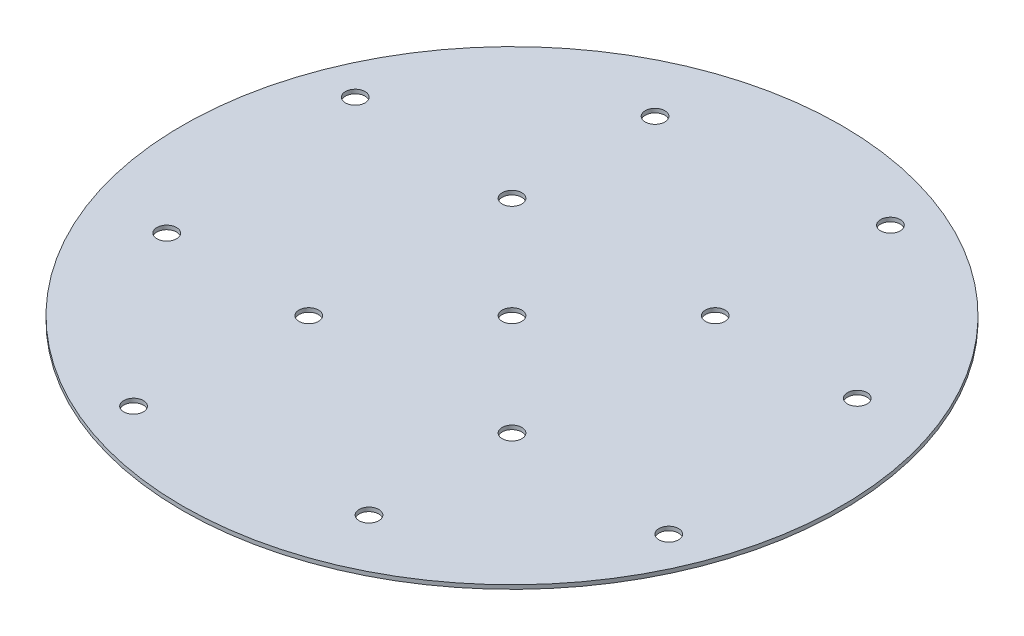
ISO-10303-21;
HEADER;
FILE_DESCRIPTION(('STEP AP214'),'2;1');
FILE_NAME('part.step','',(''),(''),'','','');
FILE_SCHEMA(('AUTOMOTIVE_DESIGN { 1 0 10303 214 1 1 1 1 }'));
ENDSEC;
DATA;
#1=APPLICATION_CONTEXT('core data for automotive mechanical design processes');
#2=APPLICATION_PROTOCOL_DEFINITION('international standard','automotive_design',2000,#1);
#3=PRODUCT_CONTEXT('',#1,'mechanical');
#4=PRODUCT('Part','Part','',(#3));
#5=PRODUCT_RELATED_PRODUCT_CATEGORY('part','',(#4));
#6=PRODUCT_DEFINITION_FORMATION('','',#4);
#7=PRODUCT_DEFINITION_CONTEXT('part definition',#1,'design');
#8=PRODUCT_DEFINITION('design','',#6,#7);
#9=PRODUCT_DEFINITION_SHAPE('','',#8);
#10=(LENGTH_UNIT() NAMED_UNIT(*) SI_UNIT(.MILLI.,.METRE.));
#11=(NAMED_UNIT(*) PLANE_ANGLE_UNIT() SI_UNIT($,.RADIAN.));
#12=(NAMED_UNIT(*) SI_UNIT($,.STERADIAN.) SOLID_ANGLE_UNIT());
#13=UNCERTAINTY_MEASURE_WITH_UNIT(LENGTH_MEASURE(1.E-05),#10,'distance_accuracy_value','');
#14=(GEOMETRIC_REPRESENTATION_CONTEXT(3) GLOBAL_UNCERTAINTY_ASSIGNED_CONTEXT((#13)) GLOBAL_UNIT_ASSIGNED_CONTEXT((#10,
#11,#12)) REPRESENTATION_CONTEXT('',''));
#15=CARTESIAN_POINT('',(0.,0.,0.));
#16=DIRECTION('',(0.,0.,1.));
#17=DIRECTION('',(1.,0.,0.));
#18=AXIS2_PLACEMENT_3D('',#15,#16,#17);
#19=CARTESIAN_POINT('',(0.,0.999999999999989,82.55));
#20=DIRECTION('',(0.,-1.,0.));
#21=DIRECTION('',(0.,0.,-1.));
#22=AXIS2_PLACEMENT_3D('',#19,#20,#21);
#23=PLANE('',#22);
#24=CARTESIAN_POINT('',(0.,0.999999999999989,0.));
#25=DIRECTION('',(0.,1.,0.));
#26=DIRECTION('',(0.,0.,1.));
#27=AXIS2_PLACEMENT_3D('',#24,#25,#26);
#28=CIRCLE('',#27,2.45745);
#29=CARTESIAN_POINT('',(0.,0.999999999999989,2.45745));
#30=VERTEX_POINT('',#29);
#31=EDGE_CURVE('E123',#30,#30,#28,.T.);
#32=ORIENTED_EDGE('',*,*,#31,.F.);
#33=EDGE_LOOP('',(#32));
#34=FACE_BOUND('',#33,.T.);
#35=CARTESIAN_POINT('',(25.333643222569,0.999999999999989,61.1608250522472));
#36=DIRECTION('',(0.,1.,0.));
#37=DIRECTION('',(0.,0.,1.));
#38=AXIS2_PLACEMENT_3D('',#35,#36,#37);
#39=CIRCLE('',#38,2.45745);
#40=CARTESIAN_POINT('',(25.333643222569,0.999999999999989,63.6182750522472));
#41=VERTEX_POINT('',#40);
#42=EDGE_CURVE('E99',#41,#41,#39,.T.);
#43=ORIENTED_EDGE('',*,*,#42,.F.);
#44=EDGE_LOOP('',(#43));
#45=FACE_BOUND('',#44,.T.);
#46=CARTESIAN_POINT('',(67.0274600836939,0.999999999999989,27.7636830180871));
#47=DIRECTION('',(0.,1.,0.));
#48=DIRECTION('',(0.,0.,1.));
#49=AXIS2_PLACEMENT_3D('',#46,#47,#48);
#50=CIRCLE('',#49,2.45745);
#51=CARTESIAN_POINT('',(67.0274600836939,0.999999999999989,30.2211330180871));
#52=VERTEX_POINT('',#51);
#53=EDGE_CURVE('E93',#52,#52,#50,.T.);
#54=ORIENTED_EDGE('',*,*,#53,.F.);
#55=EDGE_LOOP('',(#54));
#56=FACE_BOUND('',#55,.T.);
#57=CARTESIAN_POINT('',(25.4558441227157,0.999999999999989,25.4558441227157));
#58=DIRECTION('',(0.,1.,0.));
#59=DIRECTION('',(0.,0.,1.));
#60=AXIS2_PLACEMENT_3D('',#57,#58,#59);
#61=CIRCLE('',#60,2.45745);
#62=CARTESIAN_POINT('',(25.4558441227157,0.999999999999989,27.9132941227157));
#63=VERTEX_POINT('',#62);
#64=EDGE_CURVE('E87',#63,#63,#61,.T.);
#65=ORIENTED_EDGE('',*,*,#64,.F.);
#66=EDGE_LOOP('',(#65));
#67=FACE_BOUND('',#66,.T.);
#68=CARTESIAN_POINT('',(-27.7636830180869,0.999999999999989,67.027460083694));
#69=DIRECTION('',(0.,1.,0.));
#70=DIRECTION('',(0.,0.,1.));
#71=AXIS2_PLACEMENT_3D('',#68,#69,#70);
#72=CIRCLE('',#71,2.45745);
#73=CARTESIAN_POINT('',(-27.7636830180869,0.999999999999989,69.484910083694));
#74=VERTEX_POINT('',#73);
#75=EDGE_CURVE('E75',#74,#74,#72,.T.);
#76=ORIENTED_EDGE('',*,*,#75,.F.);
#77=EDGE_LOOP('',(#76));
#78=FACE_BOUND('',#77,.T.);
#79=CARTESIAN_POINT('',(-25.4558441227156,0.999999999999989,25.4558441227158));
#80=DIRECTION('',(0.,1.,0.));
#81=DIRECTION('',(0.,0.,1.));
#82=AXIS2_PLACEMENT_3D('',#79,#80,#81);
#83=CIRCLE('',#82,2.45745);
#84=CARTESIAN_POINT('',(-25.4558441227156,0.999999999999989,27.9132941227158));
#85=VERTEX_POINT('',#84);
#86=EDGE_CURVE('E69',#85,#85,#83,.T.);
#87=ORIENTED_EDGE('',*,*,#86,.F.);
#88=EDGE_LOOP('',(#87));
#89=FACE_BOUND('',#88,.T.);
#90=CARTESIAN_POINT('',(-25.333643222569,0.999999999999989,-61.1608250522472));
#91=DIRECTION('',(0.,1.,0.));
#92=DIRECTION('',(0.,0.,1.));
#93=AXIS2_PLACEMENT_3D('',#90,#91,#92);
#94=CIRCLE('',#93,2.45745);
#95=CARTESIAN_POINT('',(-25.333643222569,0.999999999999989,-58.7033750522472));
#96=VERTEX_POINT('',#95);
#97=EDGE_CURVE('E63',#96,#96,#94,.T.);
#98=ORIENTED_EDGE('',*,*,#97,.F.);
#99=EDGE_LOOP('',(#98));
#100=FACE_BOUND('',#99,.T.);
#101=CARTESIAN_POINT('',(-67.0274600836939,0.999999999999989,-27.7636830180871));
#102=DIRECTION('',(0.,1.,0.));
#103=DIRECTION('',(0.,0.,1.));
#104=AXIS2_PLACEMENT_3D('',#101,#102,#103);
#105=CIRCLE('',#104,2.45745);
#106=CARTESIAN_POINT('',(-67.0274600836939,0.999999999999989,-25.3062330180871));
#107=VERTEX_POINT('',#106);
#108=EDGE_CURVE('E57',#107,#107,#105,.T.);
#109=ORIENTED_EDGE('',*,*,#108,.F.);
#110=EDGE_LOOP('',(#109));
#111=FACE_BOUND('',#110,.T.);
#112=CARTESIAN_POINT('',(-25.4558441227157,0.999999999999989,-25.4558441227157));
#113=DIRECTION('',(0.,1.,0.));
#114=DIRECTION('',(0.,0.,1.));
#115=AXIS2_PLACEMENT_3D('',#112,#113,#114);
#116=CIRCLE('',#115,2.45745);
#117=CARTESIAN_POINT('',(-25.4558441227157,0.999999999999989,-22.9983941227157));
#118=VERTEX_POINT('',#117);
#119=EDGE_CURVE('E49',#118,#118,#116,.T.);
#120=ORIENTED_EDGE('',*,*,#119,.F.);
#121=EDGE_LOOP('',(#120));
#122=FACE_BOUND('',#121,.T.);
#123=CARTESIAN_POINT('',(0.,0.99999999999999,0.));
#124=DIRECTION('',(0.,-1.,0.));
#125=DIRECTION('',(0.,0.,-1.));
#126=AXIS2_PLACEMENT_3D('',#123,#124,#125);
#127=CIRCLE('',#126,82.55);
#128=CARTESIAN_POINT('',(0.,0.99999999999999,-82.55));
#129=VERTEX_POINT('',#128);
#130=EDGE_CURVE('E41',#129,#129,#127,.T.);
#131=ORIENTED_EDGE('',*,*,#130,.F.);
#132=EDGE_LOOP('',(#131));
#133=FACE_BOUND('',#132,.T.);
#134=CARTESIAN_POINT('',(-61.1608250522471,0.999999999999989,25.3336432225692));
#135=DIRECTION('',(0.,1.,0.));
#136=DIRECTION('',(0.,0.,1.));
#137=AXIS2_PLACEMENT_3D('',#134,#135,#136);
#138=CIRCLE('',#137,2.45745);
#139=CARTESIAN_POINT('',(-61.1608250522471,0.999999999999989,27.7910932225692));
#140=VERTEX_POINT('',#139);
#141=EDGE_CURVE('E81',#140,#140,#138,.T.);
#142=ORIENTED_EDGE('',*,*,#141,.F.);
#143=EDGE_LOOP('',(#142));
#144=FACE_BOUND('',#143,.T.);
#145=CARTESIAN_POINT('',(25.4558441227154,0.999999999999989,-25.455844122716));
#146=DIRECTION('',(0.,1.,0.));
#147=DIRECTION('',(0.,0.,1.));
#148=AXIS2_PLACEMENT_3D('',#145,#146,#147);
#149=CIRCLE('',#148,2.45745);
#150=CARTESIAN_POINT('',(25.4558441227154,0.999999999999989,-22.998394122716));
#151=VERTEX_POINT('',#150);
#152=EDGE_CURVE('E105',#151,#151,#149,.T.);
#153=ORIENTED_EDGE('',*,*,#152,.F.);
#154=EDGE_LOOP('',(#153));
#155=FACE_BOUND('',#154,.T.);
#156=CARTESIAN_POINT('',(27.7636830180864,0.999999999999989,-67.0274600836942));
#157=DIRECTION('',(0.,1.,0.));
#158=DIRECTION('',(0.,0.,1.));
#159=AXIS2_PLACEMENT_3D('',#156,#157,#158);
#160=CIRCLE('',#159,2.45745);
#161=CARTESIAN_POINT('',(27.7636830180864,0.999999999999989,-64.5700100836942));
#162=VERTEX_POINT('',#161);
#163=EDGE_CURVE('E111',#162,#162,#160,.T.);
#164=ORIENTED_EDGE('',*,*,#163,.F.);
#165=EDGE_LOOP('',(#164));
#166=FACE_BOUND('',#165,.T.);
#167=CARTESIAN_POINT('',(61.1608250522469,0.999999999999989,-25.3336432225696));
#168=DIRECTION('',(0.,1.,0.));
#169=DIRECTION('',(0.,0.,1.));
#170=AXIS2_PLACEMENT_3D('',#167,#168,#169);
#171=CIRCLE('',#170,2.45744999999999);
#172=CARTESIAN_POINT('',(61.1608250522469,0.999999999999989,-22.8761932225696));
#173=VERTEX_POINT('',#172);
#174=EDGE_CURVE('E117',#173,#173,#171,.T.);
#175=ORIENTED_EDGE('',*,*,#174,.F.);
#176=EDGE_LOOP('',(#175));
#177=FACE_BOUND('',#176,.T.);
#178=ADVANCED_FACE('F34',(#34,#45,#56,#67,#78,#89,#100,#111,#122,#133,#144,#155,#166,#177),#23,.F.);
#179=CARTESIAN_POINT('',(0.,0.,0.));
#180=DIRECTION('',(0.,1.,0.));
#181=DIRECTION('',(0.,0.,1.));
#182=AXIS2_PLACEMENT_3D('',#179,#180,#181);
#183=PLANE('',#182);
#184=CARTESIAN_POINT('',(0.,0.,0.));
#185=DIRECTION('',(0.,1.,0.));
#186=DIRECTION('',(0.,0.,1.));
#187=AXIS2_PLACEMENT_3D('',#184,#185,#186);
#188=CIRCLE('',#187,2.45745);
#189=CARTESIAN_POINT('',(0.,0.,2.45745));
#190=VERTEX_POINT('',#189);
#191=EDGE_CURVE('E120',#190,#190,#188,.T.);
#192=ORIENTED_EDGE('',*,*,#191,.T.);
#193=EDGE_LOOP('',(#192));
#194=FACE_BOUND('',#193,.T.);
#195=CARTESIAN_POINT('',(61.1608250522469,0.,-25.3336432225696));
#196=DIRECTION('',(0.,1.,0.));
#197=DIRECTION('',(0.,0.,1.));
#198=AXIS2_PLACEMENT_3D('',#195,#196,#197);
#199=CIRCLE('',#198,2.45744999999999);
#200=CARTESIAN_POINT('',(61.1608250522469,0.,-22.8761932225696));
#201=VERTEX_POINT('',#200);
#202=EDGE_CURVE('E114',#201,#201,#199,.T.);
#203=ORIENTED_EDGE('',*,*,#202,.T.);
#204=EDGE_LOOP('',(#203));
#205=FACE_BOUND('',#204,.T.);
#206=CARTESIAN_POINT('',(27.7636830180864,0.,-67.0274600836942));
#207=DIRECTION('',(0.,1.,0.));
#208=DIRECTION('',(0.,0.,1.));
#209=AXIS2_PLACEMENT_3D('',#206,#207,#208);
#210=CIRCLE('',#209,2.45745);
#211=CARTESIAN_POINT('',(27.7636830180864,0.,-64.5700100836942));
#212=VERTEX_POINT('',#211);
#213=EDGE_CURVE('E108',#212,#212,#210,.T.);
#214=ORIENTED_EDGE('',*,*,#213,.T.);
#215=EDGE_LOOP('',(#214));
#216=FACE_BOUND('',#215,.T.);
#217=CARTESIAN_POINT('',(25.4558441227154,0.,-25.455844122716));
#218=DIRECTION('',(0.,1.,0.));
#219=DIRECTION('',(0.,0.,1.));
#220=AXIS2_PLACEMENT_3D('',#217,#218,#219);
#221=CIRCLE('',#220,2.45745);
#222=CARTESIAN_POINT('',(25.4558441227154,0.,-22.998394122716));
#223=VERTEX_POINT('',#222);
#224=EDGE_CURVE('E102',#223,#223,#221,.T.);
#225=ORIENTED_EDGE('',*,*,#224,.T.);
#226=EDGE_LOOP('',(#225));
#227=FACE_BOUND('',#226,.T.);
#228=CARTESIAN_POINT('',(25.333643222569,0.,61.1608250522472));
#229=DIRECTION('',(0.,1.,0.));
#230=DIRECTION('',(0.,0.,1.));
#231=AXIS2_PLACEMENT_3D('',#228,#229,#230);
#232=CIRCLE('',#231,2.45745);
#233=CARTESIAN_POINT('',(25.333643222569,0.,63.6182750522472));
#234=VERTEX_POINT('',#233);
#235=EDGE_CURVE('E96',#234,#234,#232,.T.);
#236=ORIENTED_EDGE('',*,*,#235,.T.);
#237=EDGE_LOOP('',(#236));
#238=FACE_BOUND('',#237,.T.);
#239=CARTESIAN_POINT('',(67.0274600836939,0.,27.7636830180871));
#240=DIRECTION('',(0.,1.,0.));
#241=DIRECTION('',(0.,0.,1.));
#242=AXIS2_PLACEMENT_3D('',#239,#240,#241);
#243=CIRCLE('',#242,2.45745);
#244=CARTESIAN_POINT('',(67.0274600836939,0.,30.2211330180871));
#245=VERTEX_POINT('',#244);
#246=EDGE_CURVE('E90',#245,#245,#243,.T.);
#247=ORIENTED_EDGE('',*,*,#246,.T.);
#248=EDGE_LOOP('',(#247));
#249=FACE_BOUND('',#248,.T.);
#250=CARTESIAN_POINT('',(25.4558441227157,0.,25.4558441227157));
#251=DIRECTION('',(0.,1.,0.));
#252=DIRECTION('',(0.,0.,1.));
#253=AXIS2_PLACEMENT_3D('',#250,#251,#252);
#254=CIRCLE('',#253,2.45745);
#255=CARTESIAN_POINT('',(25.4558441227157,0.,27.9132941227157));
#256=VERTEX_POINT('',#255);
#257=EDGE_CURVE('E84',#256,#256,#254,.T.);
#258=ORIENTED_EDGE('',*,*,#257,.T.);
#259=EDGE_LOOP('',(#258));
#260=FACE_BOUND('',#259,.T.);
#261=CARTESIAN_POINT('',(-61.1608250522471,0.,25.3336432225692));
#262=DIRECTION('',(0.,1.,0.));
#263=DIRECTION('',(0.,0.,1.));
#264=AXIS2_PLACEMENT_3D('',#261,#262,#263);
#265=CIRCLE('',#264,2.45745);
#266=CARTESIAN_POINT('',(-61.1608250522471,0.,27.7910932225692));
#267=VERTEX_POINT('',#266);
#268=EDGE_CURVE('E78',#267,#267,#265,.T.);
#269=ORIENTED_EDGE('',*,*,#268,.T.);
#270=EDGE_LOOP('',(#269));
#271=FACE_BOUND('',#270,.T.);
#272=CARTESIAN_POINT('',(-27.7636830180869,0.,67.027460083694));
#273=DIRECTION('',(0.,1.,0.));
#274=DIRECTION('',(0.,0.,1.));
#275=AXIS2_PLACEMENT_3D('',#272,#273,#274);
#276=CIRCLE('',#275,2.45745);
#277=CARTESIAN_POINT('',(-27.7636830180869,0.,69.484910083694));
#278=VERTEX_POINT('',#277);
#279=EDGE_CURVE('E72',#278,#278,#276,.T.);
#280=ORIENTED_EDGE('',*,*,#279,.T.);
#281=EDGE_LOOP('',(#280));
#282=FACE_BOUND('',#281,.T.);
#283=CARTESIAN_POINT('',(-25.4558441227156,0.,25.4558441227158));
#284=DIRECTION('',(0.,1.,0.));
#285=DIRECTION('',(0.,0.,1.));
#286=AXIS2_PLACEMENT_3D('',#283,#284,#285);
#287=CIRCLE('',#286,2.45745);
#288=CARTESIAN_POINT('',(-25.4558441227156,0.,27.9132941227158));
#289=VERTEX_POINT('',#288);
#290=EDGE_CURVE('E66',#289,#289,#287,.T.);
#291=ORIENTED_EDGE('',*,*,#290,.T.);
#292=EDGE_LOOP('',(#291));
#293=FACE_BOUND('',#292,.T.);
#294=CARTESIAN_POINT('',(-25.333643222569,0.,-61.1608250522472));
#295=DIRECTION('',(0.,1.,0.));
#296=DIRECTION('',(0.,0.,1.));
#297=AXIS2_PLACEMENT_3D('',#294,#295,#296);
#298=CIRCLE('',#297,2.45745);
#299=CARTESIAN_POINT('',(-25.333643222569,0.,-58.7033750522472));
#300=VERTEX_POINT('',#299);
#301=EDGE_CURVE('E60',#300,#300,#298,.T.);
#302=ORIENTED_EDGE('',*,*,#301,.T.);
#303=EDGE_LOOP('',(#302));
#304=FACE_BOUND('',#303,.T.);
#305=CARTESIAN_POINT('',(-67.0274600836939,0.,-27.7636830180871));
#306=DIRECTION('',(0.,1.,0.));
#307=DIRECTION('',(0.,0.,1.));
#308=AXIS2_PLACEMENT_3D('',#305,#306,#307);
#309=CIRCLE('',#308,2.45745);
#310=CARTESIAN_POINT('',(-67.0274600836939,0.,-25.3062330180871));
#311=VERTEX_POINT('',#310);
#312=EDGE_CURVE('E54',#311,#311,#309,.T.);
#313=ORIENTED_EDGE('',*,*,#312,.T.);
#314=EDGE_LOOP('',(#313));
#315=FACE_BOUND('',#314,.T.);
#316=CARTESIAN_POINT('',(-25.4558441227157,0.,-25.4558441227157));
#317=DIRECTION('',(0.,1.,0.));
#318=DIRECTION('',(0.,0.,1.));
#319=AXIS2_PLACEMENT_3D('',#316,#317,#318);
#320=CIRCLE('',#319,2.45745);
#321=CARTESIAN_POINT('',(-25.4558441227157,0.,-22.9983941227157));
#322=VERTEX_POINT('',#321);
#323=EDGE_CURVE('E45',#322,#322,#320,.T.);
#324=ORIENTED_EDGE('',*,*,#323,.T.);
#325=EDGE_LOOP('',(#324));
#326=FACE_BOUND('',#325,.T.);
#327=CARTESIAN_POINT('',(0.,0.,0.));
#328=DIRECTION('',(0.,-1.,0.));
#329=DIRECTION('',(0.,0.,-1.));
#330=AXIS2_PLACEMENT_3D('',#327,#328,#329);
#331=CIRCLE('',#330,82.55);
#332=CARTESIAN_POINT('',(0.,0.,-82.55));
#333=VERTEX_POINT('',#332);
#334=EDGE_CURVE('E10',#333,#333,#331,.T.);
#335=ORIENTED_EDGE('',*,*,#334,.T.);
#336=EDGE_LOOP('',(#335));
#337=FACE_BOUND('',#336,.T.);
#338=ADVANCED_FACE('F36',(#194,#205,#216,#227,#238,#249,#260,#271,#282,#293,#304,#315,#326,
#337),#183,.F.);
#339=CARTESIAN_POINT('',(0.,-0.0500000000000102,0.));
#340=DIRECTION('',(0.,-1.,0.));
#341=DIRECTION('',(0.,0.,-1.));
#342=AXIS2_PLACEMENT_3D('',#339,#340,#341);
#343=CYLINDRICAL_SURFACE('',#342,82.55);
#344=ORIENTED_EDGE('',*,*,#334,.F.);
#345=EDGE_LOOP('',(#344));
#346=FACE_BOUND('',#345,.T.);
#347=ORIENTED_EDGE('',*,*,#130,.T.);
#348=EDGE_LOOP('',(#347));
#349=FACE_BOUND('',#348,.T.);
#350=ADVANCED_FACE('F210',(#346,#349),#343,.T.);
#351=CARTESIAN_POINT('',(-25.4558441227157,0.999999999999989,-25.4558441227157));
#352=DIRECTION('',(0.,1.,0.));
#353=DIRECTION('',(0.,0.,1.));
#354=AXIS2_PLACEMENT_3D('',#351,#352,#353);
#355=CYLINDRICAL_SURFACE('',#354,2.45745);
#356=ORIENTED_EDGE('',*,*,#323,.F.);
#357=EDGE_LOOP('',(#356));
#358=FACE_BOUND('',#357,.T.);
#359=ORIENTED_EDGE('',*,*,#119,.T.);
#360=EDGE_LOOP('',(#359));
#361=FACE_BOUND('',#360,.T.);
#362=ADVANCED_FACE('F207',(#358,#361),#355,.F.);
#363=CARTESIAN_POINT('',(-67.0274600836939,0.999999999999989,-27.7636830180871));
#364=DIRECTION('',(0.,1.,0.));
#365=DIRECTION('',(0.,0.,1.));
#366=AXIS2_PLACEMENT_3D('',#363,#364,#365);
#367=CYLINDRICAL_SURFACE('',#366,2.45745);
#368=ORIENTED_EDGE('',*,*,#312,.F.);
#369=EDGE_LOOP('',(#368));
#370=FACE_BOUND('',#369,.T.);
#371=ORIENTED_EDGE('',*,*,#108,.T.);
#372=EDGE_LOOP('',(#371));
#373=FACE_BOUND('',#372,.T.);
#374=ADVANCED_FACE('F203',(#370,#373),#367,.F.);
#375=CARTESIAN_POINT('',(-25.333643222569,0.999999999999989,-61.1608250522472));
#376=DIRECTION('',(0.,1.,0.));
#377=DIRECTION('',(0.,0.,1.));
#378=AXIS2_PLACEMENT_3D('',#375,#376,#377);
#379=CYLINDRICAL_SURFACE('',#378,2.45745);
#380=ORIENTED_EDGE('',*,*,#301,.F.);
#381=EDGE_LOOP('',(#380));
#382=FACE_BOUND('',#381,.T.);
#383=ORIENTED_EDGE('',*,*,#97,.T.);
#384=EDGE_LOOP('',(#383));
#385=FACE_BOUND('',#384,.T.);
#386=ADVANCED_FACE('F199',(#382,#385),#379,.F.);
#387=CARTESIAN_POINT('',(-25.4558441227156,0.999999999999989,25.4558441227158));
#388=DIRECTION('',(0.,1.,0.));
#389=DIRECTION('',(0.,0.,1.));
#390=AXIS2_PLACEMENT_3D('',#387,#388,#389);
#391=CYLINDRICAL_SURFACE('',#390,2.45745);
#392=ORIENTED_EDGE('',*,*,#290,.F.);
#393=EDGE_LOOP('',(#392));
#394=FACE_BOUND('',#393,.T.);
#395=ORIENTED_EDGE('',*,*,#86,.T.);
#396=EDGE_LOOP('',(#395));
#397=FACE_BOUND('',#396,.T.);
#398=ADVANCED_FACE('F195',(#394,#397),#391,.F.);
#399=CARTESIAN_POINT('',(-27.7636830180869,0.999999999999989,67.027460083694));
#400=DIRECTION('',(0.,1.,0.));
#401=DIRECTION('',(0.,0.,1.));
#402=AXIS2_PLACEMENT_3D('',#399,#400,#401);
#403=CYLINDRICAL_SURFACE('',#402,2.45745);
#404=ORIENTED_EDGE('',*,*,#279,.F.);
#405=EDGE_LOOP('',(#404));
#406=FACE_BOUND('',#405,.T.);
#407=ORIENTED_EDGE('',*,*,#75,.T.);
#408=EDGE_LOOP('',(#407));
#409=FACE_BOUND('',#408,.T.);
#410=ADVANCED_FACE('F191',(#406,#409),#403,.F.);
#411=CARTESIAN_POINT('',(-61.1608250522471,0.999999999999989,25.3336432225692));
#412=DIRECTION('',(0.,1.,0.));
#413=DIRECTION('',(0.,0.,1.));
#414=AXIS2_PLACEMENT_3D('',#411,#412,#413);
#415=CYLINDRICAL_SURFACE('',#414,2.45745);
#416=ORIENTED_EDGE('',*,*,#268,.F.);
#417=EDGE_LOOP('',(#416));
#418=FACE_BOUND('',#417,.T.);
#419=ORIENTED_EDGE('',*,*,#141,.T.);
#420=EDGE_LOOP('',(#419));
#421=FACE_BOUND('',#420,.T.);
#422=ADVANCED_FACE('F187',(#418,#421),#415,.F.);
#423=CARTESIAN_POINT('',(25.4558441227157,0.999999999999989,25.4558441227157));
#424=DIRECTION('',(0.,1.,0.));
#425=DIRECTION('',(0.,0.,1.));
#426=AXIS2_PLACEMENT_3D('',#423,#424,#425);
#427=CYLINDRICAL_SURFACE('',#426,2.45745);
#428=ORIENTED_EDGE('',*,*,#257,.F.);
#429=EDGE_LOOP('',(#428));
#430=FACE_BOUND('',#429,.T.);
#431=ORIENTED_EDGE('',*,*,#64,.T.);
#432=EDGE_LOOP('',(#431));
#433=FACE_BOUND('',#432,.T.);
#434=ADVANCED_FACE('F183',(#430,#433),#427,.F.);
#435=CARTESIAN_POINT('',(67.0274600836939,0.999999999999989,27.7636830180871));
#436=DIRECTION('',(0.,1.,0.));
#437=DIRECTION('',(0.,0.,1.));
#438=AXIS2_PLACEMENT_3D('',#435,#436,#437);
#439=CYLINDRICAL_SURFACE('',#438,2.45745);
#440=ORIENTED_EDGE('',*,*,#246,.F.);
#441=EDGE_LOOP('',(#440));
#442=FACE_BOUND('',#441,.T.);
#443=ORIENTED_EDGE('',*,*,#53,.T.);
#444=EDGE_LOOP('',(#443));
#445=FACE_BOUND('',#444,.T.);
#446=ADVANCED_FACE('F179',(#442,#445),#439,.F.);
#447=CARTESIAN_POINT('',(25.333643222569,0.999999999999989,61.1608250522472));
#448=DIRECTION('',(0.,1.,0.));
#449=DIRECTION('',(0.,0.,1.));
#450=AXIS2_PLACEMENT_3D('',#447,#448,#449);
#451=CYLINDRICAL_SURFACE('',#450,2.45745);
#452=ORIENTED_EDGE('',*,*,#235,.F.);
#453=EDGE_LOOP('',(#452));
#454=FACE_BOUND('',#453,.T.);
#455=ORIENTED_EDGE('',*,*,#42,.T.);
#456=EDGE_LOOP('',(#455));
#457=FACE_BOUND('',#456,.T.);
#458=ADVANCED_FACE('F175',(#454,#457),#451,.F.);
#459=CARTESIAN_POINT('',(25.4558441227154,0.999999999999989,-25.455844122716));
#460=DIRECTION('',(0.,1.,0.));
#461=DIRECTION('',(0.,0.,1.));
#462=AXIS2_PLACEMENT_3D('',#459,#460,#461);
#463=CYLINDRICAL_SURFACE('',#462,2.45745);
#464=ORIENTED_EDGE('',*,*,#224,.F.);
#465=EDGE_LOOP('',(#464));
#466=FACE_BOUND('',#465,.T.);
#467=ORIENTED_EDGE('',*,*,#152,.T.);
#468=EDGE_LOOP('',(#467));
#469=FACE_BOUND('',#468,.T.);
#470=ADVANCED_FACE('F168',(#466,#469),#463,.F.);
#471=CARTESIAN_POINT('',(27.7636830180864,0.999999999999989,-67.0274600836942));
#472=DIRECTION('',(0.,1.,0.));
#473=DIRECTION('',(0.,0.,1.));
#474=AXIS2_PLACEMENT_3D('',#471,#472,#473);
#475=CYLINDRICAL_SURFACE('',#474,2.45745);
#476=ORIENTED_EDGE('',*,*,#213,.F.);
#477=EDGE_LOOP('',(#476));
#478=FACE_BOUND('',#477,.T.);
#479=ORIENTED_EDGE('',*,*,#163,.T.);
#480=EDGE_LOOP('',(#479));
#481=FACE_BOUND('',#480,.T.);
#482=ADVANCED_FACE('F159',(#478,#481),#475,.F.);
#483=CARTESIAN_POINT('',(61.1608250522469,0.999999999999989,-25.3336432225696));
#484=DIRECTION('',(0.,1.,0.));
#485=DIRECTION('',(0.,0.,1.));
#486=AXIS2_PLACEMENT_3D('',#483,#484,#485);
#487=CYLINDRICAL_SURFACE('',#486,2.45744999999999);
#488=ORIENTED_EDGE('',*,*,#202,.F.);
#489=EDGE_LOOP('',(#488));
#490=FACE_BOUND('',#489,.T.);
#491=ORIENTED_EDGE('',*,*,#174,.T.);
#492=EDGE_LOOP('',(#491));
#493=FACE_BOUND('',#492,.T.);
#494=ADVANCED_FACE('F157',(#490,#493),#487,.F.);
#495=CARTESIAN_POINT('',(0.,0.999999999999989,0.));
#496=DIRECTION('',(0.,1.,0.));
#497=DIRECTION('',(0.,0.,1.));
#498=AXIS2_PLACEMENT_3D('',#495,#496,#497);
#499=CYLINDRICAL_SURFACE('',#498,2.45745);
#500=ORIENTED_EDGE('',*,*,#191,.F.);
#501=EDGE_LOOP('',(#500));
#502=FACE_BOUND('',#501,.T.);
#503=ORIENTED_EDGE('',*,*,#31,.T.);
#504=EDGE_LOOP('',(#503));
#505=FACE_BOUND('',#504,.T.);
#506=ADVANCED_FACE('F127',(#502,#505),#499,.F.);
#507=CLOSED_SHELL('',(#178,#338,#350,#362,#374,#386,#398,#410,#422,#434,#446,#458,#470,#482,
#494,#506));
#508=MANIFOLD_SOLID_BREP('B2',#507);
#509=ADVANCED_BREP_SHAPE_REPRESENTATION('',(#18,#508),#14);
#510=SHAPE_DEFINITION_REPRESENTATION(#9,#509);
ENDSEC;
END-ISO-10303-21;
